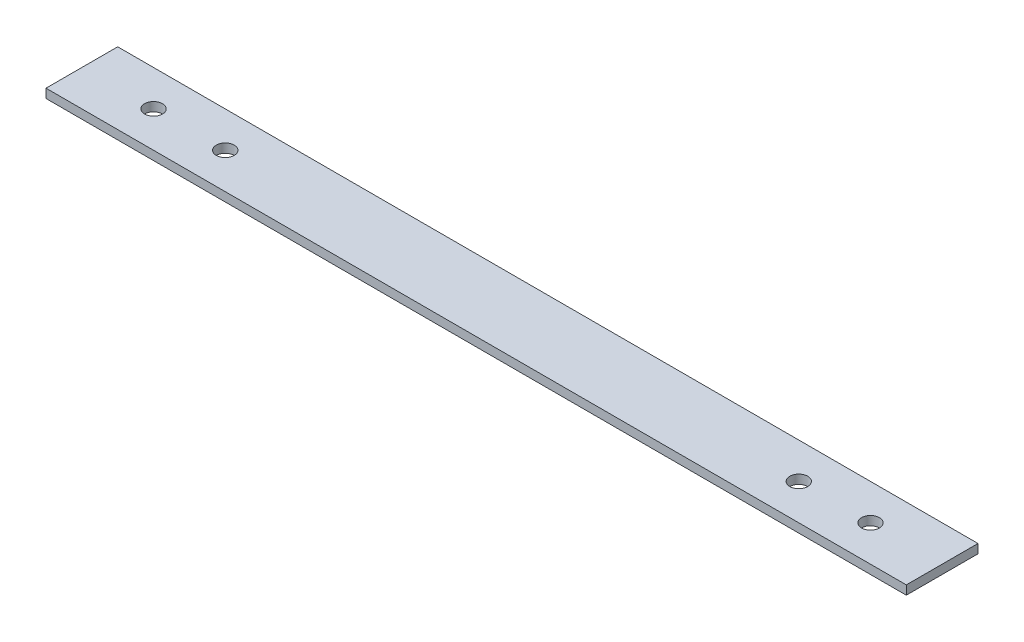
ISO-10303-21;
HEADER;
FILE_DESCRIPTION(('STEP AP214'),'2;1');
FILE_NAME('part.step','',(''),(''),'','','');
FILE_SCHEMA(('AUTOMOTIVE_DESIGN { 1 0 10303 214 1 1 1 1 }'));
ENDSEC;
DATA;
#1=APPLICATION_CONTEXT('core data for automotive mechanical design processes');
#2=APPLICATION_PROTOCOL_DEFINITION('international standard','automotive_design',2000,#1);
#3=PRODUCT_CONTEXT('',#1,'mechanical');
#4=PRODUCT('Part','Part','',(#3));
#5=PRODUCT_RELATED_PRODUCT_CATEGORY('part','',(#4));
#6=PRODUCT_DEFINITION_FORMATION('','',#4);
#7=PRODUCT_DEFINITION_CONTEXT('part definition',#1,'design');
#8=PRODUCT_DEFINITION('design','',#6,#7);
#9=PRODUCT_DEFINITION_SHAPE('','',#8);
#10=(LENGTH_UNIT() NAMED_UNIT(*) SI_UNIT(.MILLI.,.METRE.));
#11=(NAMED_UNIT(*) PLANE_ANGLE_UNIT() SI_UNIT($,.RADIAN.));
#12=(NAMED_UNIT(*) SI_UNIT($,.STERADIAN.) SOLID_ANGLE_UNIT());
#13=UNCERTAINTY_MEASURE_WITH_UNIT(LENGTH_MEASURE(1.E-05),#10,'distance_accuracy_value','');
#14=(GEOMETRIC_REPRESENTATION_CONTEXT(3) GLOBAL_UNCERTAINTY_ASSIGNED_CONTEXT((#13)) GLOBAL_UNIT_ASSIGNED_CONTEXT((#10,
#11,#12)) REPRESENTATION_CONTEXT('',''));
#15=CARTESIAN_POINT('',(0.,0.,0.));
#16=DIRECTION('',(0.,0.,1.));
#17=DIRECTION('',(1.,0.,0.));
#18=AXIS2_PLACEMENT_3D('',#15,#16,#17);
#19=CARTESIAN_POINT('',(0.,6.35,0.));
#20=DIRECTION('',(1.,0.,0.));
#21=DIRECTION('',(0.,0.,-1.));
#22=AXIS2_PLACEMENT_3D('',#19,#20,#21);
#23=PLANE('',#22);
#24=DIRECTION('',(0.,0.,1.));
#25=VECTOR('',#24,1.);
#26=CARTESIAN_POINT('',(0.,0.,0.));
#27=LINE('',#26,#25);
#28=CARTESIAN_POINT('',(0.,0.,-50.8));
#29=VERTEX_POINT('',#28);
#30=CARTESIAN_POINT('',(0.,0.,0.));
#31=VERTEX_POINT('',#30);
#32=EDGE_CURVE('E97',#29,#31,#27,.T.);
#33=ORIENTED_EDGE('',*,*,#32,.T.);
#34=DIRECTION('',(0.,-1.,0.));
#35=VECTOR('',#34,1.);
#36=CARTESIAN_POINT('',(0.,6.35,0.));
#37=LINE('',#36,#35);
#38=CARTESIAN_POINT('',(0.,6.35,0.));
#39=VERTEX_POINT('',#38);
#40=EDGE_CURVE('E11',#39,#31,#37,.T.);
#41=ORIENTED_EDGE('',*,*,#40,.F.);
#42=DIRECTION('',(0.,0.,1.));
#43=VECTOR('',#42,1.);
#44=CARTESIAN_POINT('',(0.,6.35,0.));
#45=LINE('',#44,#43);
#46=CARTESIAN_POINT('',(0.,6.35,-50.8));
#47=VERTEX_POINT('',#46);
#48=EDGE_CURVE('E85',#47,#39,#45,.T.);
#49=ORIENTED_EDGE('',*,*,#48,.F.);
#50=DIRECTION('',(0.,-1.,0.));
#51=VECTOR('',#50,1.);
#52=CARTESIAN_POINT('',(0.,6.35,-50.8));
#53=LINE('',#52,#51);
#54=EDGE_CURVE('E93',#47,#29,#53,.T.);
#55=ORIENTED_EDGE('',*,*,#54,.T.);
#56=EDGE_LOOP('',(#33,#41,#49,#55));
#57=FACE_BOUND('',#56,.T.);
#58=ADVANCED_FACE('F34',(#57),#23,.F.);
#59=CARTESIAN_POINT('',(0.,6.35,0.));
#60=DIRECTION('',(0.,0.,-1.));
#61=DIRECTION('',(-1.,0.,0.));
#62=AXIS2_PLACEMENT_3D('',#59,#60,#61);
#63=PLANE('',#62);
#64=DIRECTION('',(1.,0.,0.));
#65=VECTOR('',#64,1.);
#66=CARTESIAN_POINT('',(0.,0.,0.));
#67=LINE('',#66,#65);
#68=CARTESIAN_POINT('',(609.6,0.,0.));
#69=VERTEX_POINT('',#68);
#70=EDGE_CURVE('E89',#31,#69,#67,.T.);
#71=ORIENTED_EDGE('',*,*,#70,.T.);
#72=DIRECTION('',(0.,-1.,0.));
#73=VECTOR('',#72,1.);
#74=CARTESIAN_POINT('',(609.6,6.35,0.));
#75=LINE('',#74,#73);
#76=CARTESIAN_POINT('',(609.6,6.35,0.));
#77=VERTEX_POINT('',#76);
#78=EDGE_CURVE('E42',#77,#69,#75,.T.);
#79=ORIENTED_EDGE('',*,*,#78,.F.);
#80=DIRECTION('',(1.,0.,0.));
#81=VECTOR('',#80,1.);
#82=CARTESIAN_POINT('',(0.,6.35,0.));
#83=LINE('',#82,#81);
#84=EDGE_CURVE('E80',#39,#77,#83,.T.);
#85=ORIENTED_EDGE('',*,*,#84,.F.);
#86=ORIENTED_EDGE('',*,*,#40,.T.);
#87=EDGE_LOOP('',(#71,#79,#85,#86));
#88=FACE_BOUND('',#87,.T.);
#89=ADVANCED_FACE('F88',(#88),#63,.F.);
#90=CARTESIAN_POINT('',(609.6,6.35,0.));
#91=DIRECTION('',(-1.,0.,0.));
#92=DIRECTION('',(0.,0.,1.));
#93=AXIS2_PLACEMENT_3D('',#90,#91,#92);
#94=PLANE('',#93);
#95=DIRECTION('',(0.,0.,-1.));
#96=VECTOR('',#95,1.);
#97=CARTESIAN_POINT('',(609.6,0.,0.));
#98=LINE('',#97,#96);
#99=CARTESIAN_POINT('',(609.6,0.,-50.8));
#100=VERTEX_POINT('',#99);
#101=EDGE_CURVE('E67',#69,#100,#98,.T.);
#102=ORIENTED_EDGE('',*,*,#101,.T.);
#103=DIRECTION('',(0.,-1.,0.));
#104=VECTOR('',#103,1.);
#105=CARTESIAN_POINT('',(609.6,6.35,-50.8));
#106=LINE('',#105,#104);
#107=CARTESIAN_POINT('',(609.6,6.35,-50.8));
#108=VERTEX_POINT('',#107);
#109=EDGE_CURVE('E90',#108,#100,#106,.T.);
#110=ORIENTED_EDGE('',*,*,#109,.F.);
#111=DIRECTION('',(0.,0.,-1.));
#112=VECTOR('',#111,1.);
#113=CARTESIAN_POINT('',(609.6,6.35,0.));
#114=LINE('',#113,#112);
#115=EDGE_CURVE('E83',#77,#108,#114,.T.);
#116=ORIENTED_EDGE('',*,*,#115,.F.);
#117=ORIENTED_EDGE('',*,*,#78,.T.);
#118=EDGE_LOOP('',(#102,#110,#116,#117));
#119=FACE_BOUND('',#118,.T.);
#120=ADVANCED_FACE('F91',(#119),#94,.F.);
#121=CARTESIAN_POINT('',(0.,6.35,-50.8));
#122=DIRECTION('',(0.,0.,1.));
#123=DIRECTION('',(1.,0.,0.));
#124=AXIS2_PLACEMENT_3D('',#121,#122,#123);
#125=PLANE('',#124);
#126=DIRECTION('',(-1.,0.,0.));
#127=VECTOR('',#126,1.);
#128=CARTESIAN_POINT('',(0.,0.,-50.8));
#129=LINE('',#128,#127);
#130=EDGE_CURVE('E73',#100,#29,#129,.T.);
#131=ORIENTED_EDGE('',*,*,#130,.T.);
#132=ORIENTED_EDGE('',*,*,#54,.F.);
#133=DIRECTION('',(-1.,0.,0.));
#134=VECTOR('',#133,1.);
#135=CARTESIAN_POINT('',(0.,6.35,-50.8));
#136=LINE('',#135,#134);
#137=EDGE_CURVE('E50',#108,#47,#136,.T.);
#138=ORIENTED_EDGE('',*,*,#137,.F.);
#139=ORIENTED_EDGE('',*,*,#109,.T.);
#140=EDGE_LOOP('',(#131,#132,#138,#139));
#141=FACE_BOUND('',#140,.T.);
#142=ADVANCED_FACE('F105',(#141),#125,.F.);
#143=CARTESIAN_POINT('',(0.,6.35,0.));
#144=DIRECTION('',(0.,-1.,0.));
#145=DIRECTION('',(0.,0.,-1.));
#146=AXIS2_PLACEMENT_3D('',#143,#144,#145);
#147=PLANE('',#146);
#148=CARTESIAN_POINT('',(508.,6.35,-25.4));
#149=DIRECTION('',(0.,1.,0.));
#150=DIRECTION('',(0.,0.,1.));
#151=AXIS2_PLACEMENT_3D('',#148,#149,#150);
#152=CIRCLE('',#151,6.34999999999994);
#153=CARTESIAN_POINT('',(508.,6.35,-19.05));
#154=VERTEX_POINT('',#153);
#155=EDGE_CURVE('E129',#154,#154,#152,.T.);
#156=ORIENTED_EDGE('',*,*,#155,.F.);
#157=EDGE_LOOP('',(#156));
#158=FACE_BOUND('',#157,.T.);
#159=CARTESIAN_POINT('',(101.6,6.35,-25.3999999999999));
#160=DIRECTION('',(0.,1.,0.));
#161=DIRECTION('',(0.,0.,1.));
#162=AXIS2_PLACEMENT_3D('',#159,#160,#161);
#163=CIRCLE('',#162,6.35);
#164=CARTESIAN_POINT('',(101.6,6.35,-19.0499999999999));
#165=VERTEX_POINT('',#164);
#166=EDGE_CURVE('E123',#165,#165,#163,.T.);
#167=ORIENTED_EDGE('',*,*,#166,.F.);
#168=EDGE_LOOP('',(#167));
#169=FACE_BOUND('',#168,.T.);
#170=CARTESIAN_POINT('',(50.8,6.35,-25.3999999999999));
#171=DIRECTION('',(0.,1.,0.));
#172=DIRECTION('',(0.,0.,1.));
#173=AXIS2_PLACEMENT_3D('',#170,#171,#172);
#174=CIRCLE('',#173,6.35);
#175=CARTESIAN_POINT('',(50.8,6.35,-19.0499999999999));
#176=VERTEX_POINT('',#175);
#177=EDGE_CURVE('E117',#176,#176,#174,.T.);
#178=ORIENTED_EDGE('',*,*,#177,.F.);
#179=EDGE_LOOP('',(#178));
#180=FACE_BOUND('',#179,.T.);
#181=CARTESIAN_POINT('',(558.8,6.35,-25.4));
#182=DIRECTION('',(0.,1.,0.));
#183=DIRECTION('',(0.,0.,1.));
#184=AXIS2_PLACEMENT_3D('',#181,#182,#183);
#185=CIRCLE('',#184,6.34999999999994);
#186=CARTESIAN_POINT('',(558.8,6.35,-19.0500000000001));
#187=VERTEX_POINT('',#186);
#188=EDGE_CURVE('E111',#187,#187,#185,.T.);
#189=ORIENTED_EDGE('',*,*,#188,.F.);
#190=EDGE_LOOP('',(#189));
#191=FACE_BOUND('',#190,.T.);
#192=ORIENTED_EDGE('',*,*,#48,.T.);
#193=ORIENTED_EDGE('',*,*,#84,.T.);
#194=ORIENTED_EDGE('',*,*,#115,.T.);
#195=ORIENTED_EDGE('',*,*,#137,.T.);
#196=EDGE_LOOP('',(#192,#193,#194,#195));
#197=FACE_BOUND('',#196,.T.);
#198=ADVANCED_FACE('F81',(#158,#169,#180,#191,#197),#147,.F.);
#199=CARTESIAN_POINT('',(0.,0.,0.));
#200=DIRECTION('',(0.,-1.,0.));
#201=DIRECTION('',(0.,0.,-1.));
#202=AXIS2_PLACEMENT_3D('',#199,#200,#201);
#203=PLANE('',#202);
#204=CARTESIAN_POINT('',(508.,0.,-25.4));
#205=DIRECTION('',(0.,1.,0.));
#206=DIRECTION('',(0.,0.,1.));
#207=AXIS2_PLACEMENT_3D('',#204,#205,#206);
#208=CIRCLE('',#207,6.34999999999994);
#209=CARTESIAN_POINT('',(508.,0.,-19.05));
#210=VERTEX_POINT('',#209);
#211=EDGE_CURVE('E126',#210,#210,#208,.T.);
#212=ORIENTED_EDGE('',*,*,#211,.T.);
#213=EDGE_LOOP('',(#212));
#214=FACE_BOUND('',#213,.T.);
#215=CARTESIAN_POINT('',(101.6,0.,-25.3999999999999));
#216=DIRECTION('',(0.,1.,0.));
#217=DIRECTION('',(0.,0.,1.));
#218=AXIS2_PLACEMENT_3D('',#215,#216,#217);
#219=CIRCLE('',#218,6.35);
#220=CARTESIAN_POINT('',(101.6,0.,-19.0499999999999));
#221=VERTEX_POINT('',#220);
#222=EDGE_CURVE('E120',#221,#221,#219,.T.);
#223=ORIENTED_EDGE('',*,*,#222,.T.);
#224=EDGE_LOOP('',(#223));
#225=FACE_BOUND('',#224,.T.);
#226=CARTESIAN_POINT('',(50.8,0.,-25.3999999999999));
#227=DIRECTION('',(0.,1.,0.));
#228=DIRECTION('',(0.,0.,1.));
#229=AXIS2_PLACEMENT_3D('',#226,#227,#228);
#230=CIRCLE('',#229,6.35);
#231=CARTESIAN_POINT('',(50.8,0.,-19.0499999999999));
#232=VERTEX_POINT('',#231);
#233=EDGE_CURVE('E114',#232,#232,#230,.T.);
#234=ORIENTED_EDGE('',*,*,#233,.T.);
#235=EDGE_LOOP('',(#234));
#236=FACE_BOUND('',#235,.T.);
#237=CARTESIAN_POINT('',(558.8,0.,-25.4));
#238=DIRECTION('',(0.,1.,0.));
#239=DIRECTION('',(0.,0.,1.));
#240=AXIS2_PLACEMENT_3D('',#237,#238,#239);
#241=CIRCLE('',#240,6.34999999999994);
#242=CARTESIAN_POINT('',(558.8,0.,-19.0500000000001));
#243=VERTEX_POINT('',#242);
#244=EDGE_CURVE('E100',#243,#243,#241,.T.);
#245=ORIENTED_EDGE('',*,*,#244,.T.);
#246=EDGE_LOOP('',(#245));
#247=FACE_BOUND('',#246,.T.);
#248=ORIENTED_EDGE('',*,*,#32,.F.);
#249=ORIENTED_EDGE('',*,*,#130,.F.);
#250=ORIENTED_EDGE('',*,*,#101,.F.);
#251=ORIENTED_EDGE('',*,*,#70,.F.);
#252=EDGE_LOOP('',(#248,#249,#250,#251));
#253=FACE_BOUND('',#252,.T.);
#254=ADVANCED_FACE('F108',(#214,#225,#236,#247,#253),#203,.T.);
#255=CARTESIAN_POINT('',(558.8,0.,-25.4));
#256=DIRECTION('',(0.,1.,0.));
#257=DIRECTION('',(0.,0.,1.));
#258=AXIS2_PLACEMENT_3D('',#255,#256,#257);
#259=CYLINDRICAL_SURFACE('',#258,6.34999999999994);
#260=ORIENTED_EDGE('',*,*,#244,.F.);
#261=EDGE_LOOP('',(#260));
#262=FACE_BOUND('',#261,.T.);
#263=ORIENTED_EDGE('',*,*,#188,.T.);
#264=EDGE_LOOP('',(#263));
#265=FACE_BOUND('',#264,.T.);
#266=ADVANCED_FACE('F153',(#262,#265),#259,.F.);
#267=CARTESIAN_POINT('',(50.8,0.,-25.3999999999999));
#268=DIRECTION('',(0.,1.,0.));
#269=DIRECTION('',(0.,0.,1.));
#270=AXIS2_PLACEMENT_3D('',#267,#268,#269);
#271=CYLINDRICAL_SURFACE('',#270,6.35);
#272=ORIENTED_EDGE('',*,*,#233,.F.);
#273=EDGE_LOOP('',(#272));
#274=FACE_BOUND('',#273,.T.);
#275=ORIENTED_EDGE('',*,*,#177,.T.);
#276=EDGE_LOOP('',(#275));
#277=FACE_BOUND('',#276,.T.);
#278=ADVANCED_FACE('F155',(#274,#277),#271,.F.);
#279=CARTESIAN_POINT('',(101.6,0.,-25.3999999999999));
#280=DIRECTION('',(0.,1.,0.));
#281=DIRECTION('',(0.,0.,1.));
#282=AXIS2_PLACEMENT_3D('',#279,#280,#281);
#283=CYLINDRICAL_SURFACE('',#282,6.35);
#284=ORIENTED_EDGE('',*,*,#222,.F.);
#285=EDGE_LOOP('',(#284));
#286=FACE_BOUND('',#285,.T.);
#287=ORIENTED_EDGE('',*,*,#166,.T.);
#288=EDGE_LOOP('',(#287));
#289=FACE_BOUND('',#288,.T.);
#290=ADVANCED_FACE('F140',(#286,#289),#283,.F.);
#291=CARTESIAN_POINT('',(508.,0.,-25.4));
#292=DIRECTION('',(0.,1.,0.));
#293=DIRECTION('',(0.,0.,1.));
#294=AXIS2_PLACEMENT_3D('',#291,#292,#293);
#295=CYLINDRICAL_SURFACE('',#294,6.34999999999994);
#296=ORIENTED_EDGE('',*,*,#211,.F.);
#297=EDGE_LOOP('',(#296));
#298=FACE_BOUND('',#297,.T.);
#299=ORIENTED_EDGE('',*,*,#155,.T.);
#300=EDGE_LOOP('',(#299));
#301=FACE_BOUND('',#300,.T.);
#302=ADVANCED_FACE('F137',(#298,#301),#295,.F.);
#303=CLOSED_SHELL('',(#58,#89,#120,#142,#198,#254,#266,#278,#290,#302));
#304=MANIFOLD_SOLID_BREP('B2',#303);
#305=ADVANCED_BREP_SHAPE_REPRESENTATION('',(#18,#304),#14);
#306=SHAPE_DEFINITION_REPRESENTATION(#9,#305);
ENDSEC;
END-ISO-10303-21;
